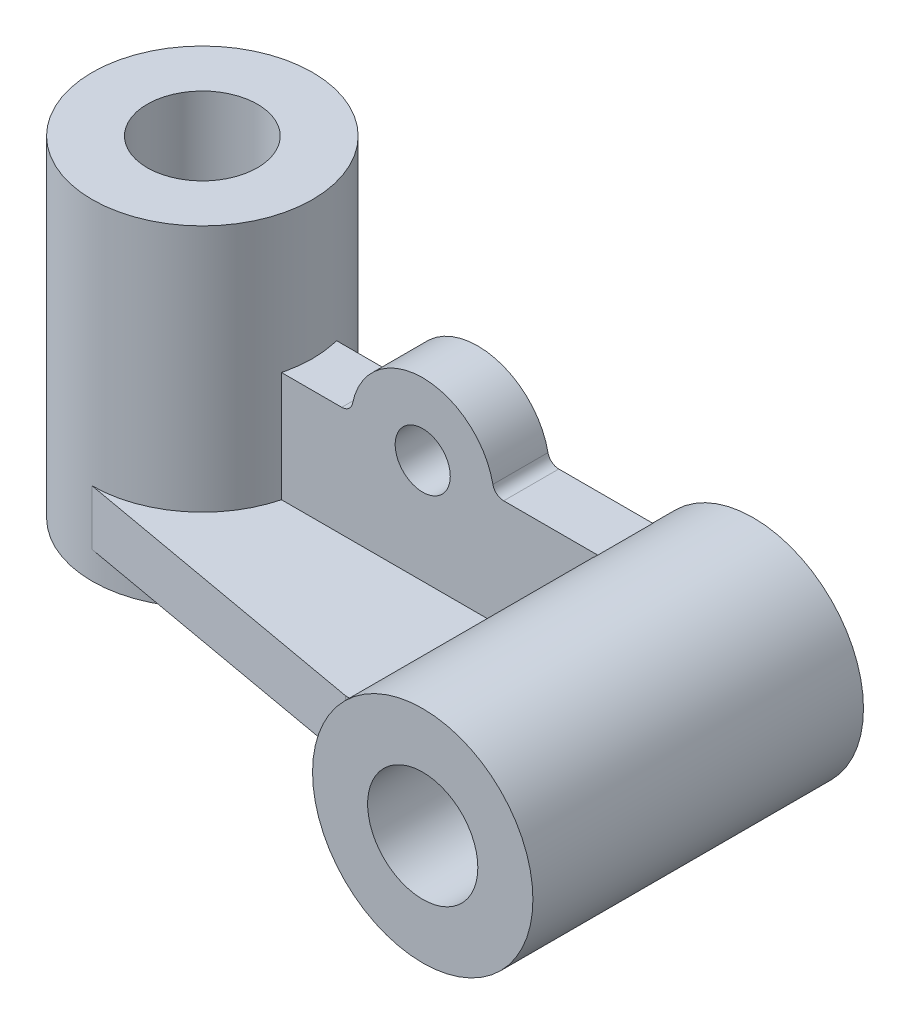
ISO-10303-21;
HEADER;
FILE_DESCRIPTION(('STEP AP214'),'2;1');
FILE_NAME('part.step','',(''),(''),'','','');
FILE_SCHEMA(('AUTOMOTIVE_DESIGN { 1 0 10303 214 1 1 1 1 }'));
ENDSEC;
DATA;
#1=APPLICATION_CONTEXT('core data for automotive mechanical design processes');
#2=APPLICATION_PROTOCOL_DEFINITION('international standard','automotive_design',2000,#1);
#3=PRODUCT_CONTEXT('',#1,'mechanical');
#4=PRODUCT('Part','Part','',(#3));
#5=PRODUCT_RELATED_PRODUCT_CATEGORY('part','',(#4));
#6=PRODUCT_DEFINITION_FORMATION('','',#4);
#7=PRODUCT_DEFINITION_CONTEXT('part definition',#1,'design');
#8=PRODUCT_DEFINITION('design','',#6,#7);
#9=PRODUCT_DEFINITION_SHAPE('','',#8);
#10=(LENGTH_UNIT() NAMED_UNIT(*) SI_UNIT(.MILLI.,.METRE.));
#11=(NAMED_UNIT(*) PLANE_ANGLE_UNIT() SI_UNIT($,.RADIAN.));
#12=(NAMED_UNIT(*) SI_UNIT($,.STERADIAN.) SOLID_ANGLE_UNIT());
#13=UNCERTAINTY_MEASURE_WITH_UNIT(LENGTH_MEASURE(1.E-05),#10,'distance_accuracy_value','');
#14=(GEOMETRIC_REPRESENTATION_CONTEXT(3) GLOBAL_UNCERTAINTY_ASSIGNED_CONTEXT((#13)) GLOBAL_UNIT_ASSIGNED_CONTEXT((#10,
#11,#12)) REPRESENTATION_CONTEXT('',''));
#15=CARTESIAN_POINT('',(0.,0.,0.));
#16=DIRECTION('',(0.,0.,1.));
#17=DIRECTION('',(1.,0.,0.));
#18=AXIS2_PLACEMENT_3D('',#15,#16,#17);
#19=CARTESIAN_POINT('',(77.3091008088365,-15.,30.));
#20=DIRECTION('',(-1.,0.,0.));
#21=DIRECTION('',(0.,0.,1.));
#22=AXIS2_PLACEMENT_3D('',#19,#20,#21);
#23=PLANE('',#22);
#24=DIRECTION('',(0.,0.,-1.));
#25=VECTOR('',#24,1.);
#26=CARTESIAN_POINT('',(77.3091008088365,-25.,30.));
#27=LINE('',#26,#25);
#28=CARTESIAN_POINT('',(77.3091008088365,-25.,30.));
#29=VERTEX_POINT('',#28);
#30=CARTESIAN_POINT('',(77.3091008088365,-25.,5.));
#31=VERTEX_POINT('',#30);
#32=EDGE_CURVE('E121',#29,#31,#27,.T.);
#33=ORIENTED_EDGE('',*,*,#32,.T.);
#34=DIRECTION('',(0.,-1.,0.));
#35=VECTOR('',#34,1.);
#36=CARTESIAN_POINT('',(77.3091008088365,-15.,5.));
#37=LINE('',#36,#35);
#38=CARTESIAN_POINT('',(77.3091008088365,-15.,5.));
#39=VERTEX_POINT('',#38);
#40=EDGE_CURVE('E12',#39,#31,#37,.T.);
#41=ORIENTED_EDGE('',*,*,#40,.F.);
#42=DIRECTION('',(0.,0.,-1.));
#43=VECTOR('',#42,1.);
#44=CARTESIAN_POINT('',(77.3091008088365,-15.,30.));
#45=LINE('',#44,#43);
#46=CARTESIAN_POINT('',(77.3091008088365,-15.,30.));
#47=VERTEX_POINT('',#46);
#48=EDGE_CURVE('E129',#47,#39,#45,.T.);
#49=ORIENTED_EDGE('',*,*,#48,.F.);
#50=DIRECTION('',(0.,-1.,0.));
#51=VECTOR('',#50,1.);
#52=CARTESIAN_POINT('',(77.3091008088365,-15.,30.));
#53=LINE('',#52,#51);
#54=EDGE_CURVE('E117',#47,#29,#53,.T.);
#55=ORIENTED_EDGE('',*,*,#54,.T.);
#56=EDGE_LOOP('',(#33,#41,#49,#55));
#57=FACE_BOUND('',#56,.T.);
#58=ADVANCED_FACE('F47',(#57),#23,.F.);
#59=CARTESIAN_POINT('',(19.3649167310371,-15.,5.));
#60=DIRECTION('',(0.,0.,1.));
#61=DIRECTION('',(1.,0.,0.));
#62=AXIS2_PLACEMENT_3D('',#59,#60,#61);
#63=PLANE('',#62);
#64=DIRECTION('',(-1.,0.,0.));
#65=VECTOR('',#64,1.);
#66=CARTESIAN_POINT('',(19.3649167310371,-25.,5.));
#67=LINE('',#66,#65);
#68=CARTESIAN_POINT('',(19.3649167310371,-25.,5.));
#69=VERTEX_POINT('',#68);
#70=EDGE_CURVE('E124',#31,#69,#67,.T.);
#71=ORIENTED_EDGE('',*,*,#70,.T.);
#72=DIRECTION('',(0.,-1.,0.));
#73=VECTOR('',#72,1.);
#74=CARTESIAN_POINT('',(19.3649167310371,-15.,5.));
#75=LINE('',#74,#73);
#76=CARTESIAN_POINT('',(19.3649167310371,-15.,5.));
#77=VERTEX_POINT('',#76);
#78=EDGE_CURVE('E55',#77,#69,#75,.T.);
#79=ORIENTED_EDGE('',*,*,#78,.F.);
#80=DIRECTION('',(-1.,0.,0.));
#81=VECTOR('',#80,1.);
#82=CARTESIAN_POINT('',(19.3649167310371,-15.,5.));
#83=LINE('',#82,#81);
#84=EDGE_CURVE('E97',#39,#77,#83,.T.);
#85=ORIENTED_EDGE('',*,*,#84,.F.);
#86=ORIENTED_EDGE('',*,*,#40,.T.);
#87=EDGE_LOOP('',(#71,#79,#85,#86));
#88=FACE_BOUND('',#87,.T.);
#89=ADVANCED_FACE('F148',(#88),#63,.F.);
#90=CARTESIAN_POINT('',(0.,-15.,0.));
#91=DIRECTION('',(0.,-1.,0.));
#92=DIRECTION('',(0.,0.,-1.));
#93=AXIS2_PLACEMENT_3D('',#90,#91,#92);
#94=CYLINDRICAL_SURFACE('',#93,20.);
#95=CARTESIAN_POINT('',(0.,-25.,0.));
#96=DIRECTION('',(0.,-1.,0.));
#97=DIRECTION('',(0.,0.,1.));
#98=AXIS2_PLACEMENT_3D('',#95,#96,#97);
#99=CIRCLE('',#98,20.);
#100=CARTESIAN_POINT('',(0.,-25.,20.));
#101=VERTEX_POINT('',#100);
#102=EDGE_CURVE('E112',#69,#101,#99,.T.);
#103=ORIENTED_EDGE('',*,*,#102,.T.);
#104=DIRECTION('',(0.,-1.,0.));
#105=VECTOR('',#104,1.);
#106=CARTESIAN_POINT('',(0.,-15.,20.));
#107=LINE('',#106,#105);
#108=CARTESIAN_POINT('',(0.,-15.,20.));
#109=VERTEX_POINT('',#108);
#110=EDGE_CURVE('E109',#109,#101,#107,.T.);
#111=ORIENTED_EDGE('',*,*,#110,.F.);
#112=CARTESIAN_POINT('',(0.,-15.,0.));
#113=DIRECTION('',(0.,-1.,0.));
#114=DIRECTION('',(0.,0.,1.));
#115=AXIS2_PLACEMENT_3D('',#112,#113,#114);
#116=CIRCLE('',#115,20.);
#117=EDGE_CURVE('E101',#77,#109,#116,.T.);
#118=ORIENTED_EDGE('',*,*,#117,.F.);
#119=ORIENTED_EDGE('',*,*,#78,.T.);
#120=EDGE_LOOP('',(#103,#111,#118,#119));
#121=FACE_BOUND('',#120,.T.);
#122=ADVANCED_FACE('F110',(#121),#94,.F.);
#123=CARTESIAN_POINT('',(0.,-15.,20.));
#124=DIRECTION('',(0.175790638483658,0.,-0.984427575508482));
#125=DIRECTION('',(-0.984427575508482,0.,-0.175790638483658));
#126=AXIS2_PLACEMENT_3D('',#123,#124,#125);
#127=PLANE('',#126);
#128=DIRECTION('',(0.984427575508482,0.,0.175790638483658));
#129=VECTOR('',#128,1.);
#130=CARTESIAN_POINT('',(0.,-25.,20.));
#131=LINE('',#130,#129);
#132=CARTESIAN_POINT('',(56.,-25.,30.));
#133=VERTEX_POINT('',#132);
#134=EDGE_CURVE('E83',#101,#133,#131,.T.);
#135=ORIENTED_EDGE('',*,*,#134,.T.);
#136=DIRECTION('',(0.,-1.,0.));
#137=VECTOR('',#136,1.);
#138=CARTESIAN_POINT('',(56.,-15.,30.));
#139=LINE('',#138,#137);
#140=CARTESIAN_POINT('',(56.,-15.,30.));
#141=VERTEX_POINT('',#140);
#142=EDGE_CURVE('E113',#141,#133,#139,.T.);
#143=ORIENTED_EDGE('',*,*,#142,.F.);
#144=DIRECTION('',(0.984427575508482,0.,0.175790638483658));
#145=VECTOR('',#144,1.);
#146=CARTESIAN_POINT('',(0.,-15.,20.));
#147=LINE('',#146,#145);
#148=EDGE_CURVE('E105',#109,#141,#147,.T.);
#149=ORIENTED_EDGE('',*,*,#148,.F.);
#150=ORIENTED_EDGE('',*,*,#110,.T.);
#151=EDGE_LOOP('',(#135,#143,#149,#150));
#152=FACE_BOUND('',#151,.T.);
#153=ADVANCED_FACE('F115',(#152),#127,.F.);
#154=CARTESIAN_POINT('',(56.,-15.,30.));
#155=DIRECTION('',(0.,0.,-1.));
#156=DIRECTION('',(-1.,0.,0.));
#157=AXIS2_PLACEMENT_3D('',#154,#155,#156);
#158=PLANE('',#157);
#159=DIRECTION('',(1.,0.,0.));
#160=VECTOR('',#159,1.);
#161=CARTESIAN_POINT('',(56.,-25.,30.));
#162=LINE('',#161,#160);
#163=EDGE_CURVE('E89',#133,#29,#162,.T.);
#164=ORIENTED_EDGE('',*,*,#163,.T.);
#165=ORIENTED_EDGE('',*,*,#54,.F.);
#166=DIRECTION('',(1.,0.,0.));
#167=VECTOR('',#166,1.);
#168=CARTESIAN_POINT('',(56.,-15.,30.));
#169=LINE('',#168,#167);
#170=EDGE_CURVE('E63',#141,#47,#169,.T.);
#171=ORIENTED_EDGE('',*,*,#170,.F.);
#172=ORIENTED_EDGE('',*,*,#142,.T.);
#173=EDGE_LOOP('',(#164,#165,#171,#172));
#174=FACE_BOUND('',#173,.T.);
#175=ADVANCED_FACE('F137',(#174),#158,.F.);
#176=CARTESIAN_POINT('',(0.,-15.,0.));
#177=DIRECTION('',(0.,1.,0.));
#178=DIRECTION('',(0.,0.,1.));
#179=AXIS2_PLACEMENT_3D('',#176,#177,#178);
#180=PLANE('',#179);
#181=ORIENTED_EDGE('',*,*,#48,.T.);
#182=ORIENTED_EDGE('',*,*,#84,.T.);
#183=ORIENTED_EDGE('',*,*,#117,.T.);
#184=ORIENTED_EDGE('',*,*,#148,.T.);
#185=ORIENTED_EDGE('',*,*,#170,.T.);
#186=EDGE_LOOP('',(#181,#182,#183,#184,#185));
#187=FACE_BOUND('',#186,.T.);
#188=ADVANCED_FACE('F103',(#187),#180,.T.);
#189=CARTESIAN_POINT('',(0.,-25.,0.));
#190=DIRECTION('',(0.,1.,0.));
#191=DIRECTION('',(0.,0.,1.));
#192=AXIS2_PLACEMENT_3D('',#189,#190,#191);
#193=PLANE('',#192);
#194=ORIENTED_EDGE('',*,*,#32,.F.);
#195=ORIENTED_EDGE('',*,*,#163,.F.);
#196=ORIENTED_EDGE('',*,*,#134,.F.);
#197=ORIENTED_EDGE('',*,*,#102,.F.);
#198=ORIENTED_EDGE('',*,*,#70,.F.);
#199=EDGE_LOOP('',(#194,#195,#196,#197,#198));
#200=FACE_BOUND('',#199,.T.);
#201=ADVANCED_FACE('F133',(#200),#193,.F.);
#202=CLOSED_SHELL('',(#58,#89,#122,#153,#175,#188,#201));
#203=MANIFOLD_SOLID_BREP('B2',#202);
#204=CARTESIAN_POINT('',(90.0000000000001,-10.,5.));
#205=DIRECTION('',(0.,0.,-1.));
#206=DIRECTION('',(-1.,0.,0.));
#207=AXIS2_PLACEMENT_3D('',#204,#205,#206);
#208=PLANE('',#207);
#209=DIRECTION('',(0.,-1.,0.));
#210=VECTOR('',#209,1.);
#211=CARTESIAN_POINT('',(10.,5.,5.));
#212=LINE('',#211,#210);
#213=CARTESIAN_POINT('',(10.,5.,5.));
#214=VERTEX_POINT('',#213);
#215=CARTESIAN_POINT('',(10.,-15.,5.));
#216=VERTEX_POINT('',#215);
#217=EDGE_CURVE('E316',#214,#216,#212,.T.);
#218=ORIENTED_EDGE('',*,*,#217,.T.);
#219=DIRECTION('',(1.,0.,0.));
#220=VECTOR('',#219,1.);
#221=CARTESIAN_POINT('',(10.,-15.,5.));
#222=LINE('',#221,#220);
#223=CARTESIAN_POINT('',(70.6350832689629,-15.,5.));
#224=VERTEX_POINT('',#223);
#225=EDGE_CURVE('E264',#216,#224,#222,.T.);
#226=ORIENTED_EDGE('',*,*,#225,.T.);
#227=CARTESIAN_POINT('',(90.0000000000001,-10.,5.));
#228=DIRECTION('',(0.,0.,-1.));
#229=DIRECTION('',(-1.,0.,0.));
#230=AXIS2_PLACEMENT_3D('',#227,#228,#229);
#231=CIRCLE('',#230,20.);
#232=CARTESIAN_POINT('',(76.7712434446771,5.,5.));
#233=VERTEX_POINT('',#232);
#234=EDGE_CURVE('E331',#224,#233,#231,.T.);
#235=ORIENTED_EDGE('',*,*,#234,.T.);
#236=DIRECTION('',(-1.,0.,0.));
#237=VECTOR('',#236,1.);
#238=CARTESIAN_POINT('',(59.6969384566991,5.,5.));
#239=LINE('',#238,#237);
#240=CARTESIAN_POINT('',(59.6969384566991,5.,5.));
#241=VERTEX_POINT('',#240);
#242=EDGE_CURVE('E344',#233,#241,#239,.T.);
#243=ORIENTED_EDGE('',*,*,#242,.T.);
#244=CARTESIAN_POINT('',(59.6969384566991,7.,5.));
#245=DIRECTION('',(0.,0.,-1.));
#246=DIRECTION('',(-1.,0.,0.));
#247=AXIS2_PLACEMENT_3D('',#244,#245,#246);
#248=CIRCLE('',#247,2.);
#249=CARTESIAN_POINT('',(57.7373466624725,6.6,5.));
#250=VERTEX_POINT('',#249);
#251=EDGE_CURVE('E283',#241,#250,#248,.T.);
#252=ORIENTED_EDGE('',*,*,#251,.T.);
#253=CARTESIAN_POINT('',(45.,4.,5.));
#254=DIRECTION('',(0.,0.,1.));
#255=DIRECTION('',(-1.,0.,0.));
#256=AXIS2_PLACEMENT_3D('',#253,#254,#255);
#257=CIRCLE('',#256,13.);
#258=CARTESIAN_POINT('',(32.2626533375275,6.6,5.));
#259=VERTEX_POINT('',#258);
#260=EDGE_CURVE('E277',#250,#259,#257,.T.);
#261=ORIENTED_EDGE('',*,*,#260,.T.);
#262=CARTESIAN_POINT('',(30.303061543301,7.,5.));
#263=DIRECTION('',(0.,0.,-1.));
#264=DIRECTION('',(1.,0.,0.));
#265=AXIS2_PLACEMENT_3D('',#262,#263,#264);
#266=CIRCLE('',#265,2.);
#267=CARTESIAN_POINT('',(30.303061543301,5.,5.));
#268=VERTEX_POINT('',#267);
#269=EDGE_CURVE('E281',#259,#268,#266,.T.);
#270=ORIENTED_EDGE('',*,*,#269,.T.);
#271=DIRECTION('',(-1.,0.,0.));
#272=VECTOR('',#271,1.);
#273=CARTESIAN_POINT('',(10.,5.,5.));
#274=LINE('',#273,#272);
#275=EDGE_CURVE('E221',#268,#214,#274,.T.);
#276=ORIENTED_EDGE('',*,*,#275,.T.);
#277=EDGE_LOOP('',(#218,#226,#235,#243,#252,#261,#270,#276));
#278=FACE_BOUND('',#277,.T.);
#279=CARTESIAN_POINT('',(45.,4.,5.));
#280=DIRECTION('',(0.,0.,1.));
#281=DIRECTION('',(1.,0.,0.));
#282=AXIS2_PLACEMENT_3D('',#279,#280,#281);
#283=CIRCLE('',#282,5.);
#284=CARTESIAN_POINT('',(50.,4.,5.));
#285=VERTEX_POINT('',#284);
#286=EDGE_CURVE('E305',#285,#285,#283,.T.);
#287=ORIENTED_EDGE('',*,*,#286,.F.);
#288=EDGE_LOOP('',(#287));
#289=FACE_BOUND('',#288,.T.);
#290=ADVANCED_FACE('F204',(#278,#289),#208,.F.);
#291=CARTESIAN_POINT('',(90.0000000000001,-10.,-5.));
#292=DIRECTION('',(0.,0.,-1.));
#293=DIRECTION('',(-1.,0.,0.));
#294=AXIS2_PLACEMENT_3D('',#291,#292,#293);
#295=PLANE('',#294);
#296=DIRECTION('',(0.,-1.,0.));
#297=VECTOR('',#296,1.);
#298=CARTESIAN_POINT('',(10.,5.,-5.));
#299=LINE('',#298,#297);
#300=CARTESIAN_POINT('',(10.,5.,-5.));
#301=VERTEX_POINT('',#300);
#302=CARTESIAN_POINT('',(10.,-15.,-5.));
#303=VERTEX_POINT('',#302);
#304=EDGE_CURVE('E301',#301,#303,#299,.T.);
#305=ORIENTED_EDGE('',*,*,#304,.F.);
#306=DIRECTION('',(-1.,0.,0.));
#307=VECTOR('',#306,1.);
#308=CARTESIAN_POINT('',(10.,5.,-5.));
#309=LINE('',#308,#307);
#310=CARTESIAN_POINT('',(30.303061543301,5.,-5.));
#311=VERTEX_POINT('',#310);
#312=EDGE_CURVE('E256',#311,#301,#309,.T.);
#313=ORIENTED_EDGE('',*,*,#312,.F.);
#314=CARTESIAN_POINT('',(30.303061543301,7.,-5.));
#315=DIRECTION('',(0.,0.,-1.));
#316=DIRECTION('',(1.,0.,0.));
#317=AXIS2_PLACEMENT_3D('',#314,#315,#316);
#318=CIRCLE('',#317,2.);
#319=CARTESIAN_POINT('',(32.2626533375275,6.6,-5.));
#320=VERTEX_POINT('',#319);
#321=EDGE_CURVE('E250',#320,#311,#318,.T.);
#322=ORIENTED_EDGE('',*,*,#321,.F.);
#323=CARTESIAN_POINT('',(45.,4.,-5.));
#324=DIRECTION('',(0.,0.,1.));
#325=DIRECTION('',(-1.,0.,0.));
#326=AXIS2_PLACEMENT_3D('',#323,#324,#325);
#327=CIRCLE('',#326,13.);
#328=CARTESIAN_POINT('',(57.7373466624725,6.6,-5.));
#329=VERTEX_POINT('',#328);
#330=EDGE_CURVE('E291',#329,#320,#327,.T.);
#331=ORIENTED_EDGE('',*,*,#330,.F.);
#332=CARTESIAN_POINT('',(59.6969384566991,7.,-5.));
#333=DIRECTION('',(0.,0.,-1.));
#334=DIRECTION('',(-1.,0.,0.));
#335=AXIS2_PLACEMENT_3D('',#332,#333,#334);
#336=CIRCLE('',#335,2.);
#337=CARTESIAN_POINT('',(59.6969384566991,5.,-5.));
#338=VERTEX_POINT('',#337);
#339=EDGE_CURVE('E311',#338,#329,#336,.T.);
#340=ORIENTED_EDGE('',*,*,#339,.F.);
#341=DIRECTION('',(-1.,0.,0.));
#342=VECTOR('',#341,1.);
#343=CARTESIAN_POINT('',(59.6969384566991,5.,-5.));
#344=LINE('',#343,#342);
#345=CARTESIAN_POINT('',(76.7712434446771,5.,-5.));
#346=VERTEX_POINT('',#345);
#347=EDGE_CURVE('E309',#346,#338,#344,.T.);
#348=ORIENTED_EDGE('',*,*,#347,.F.);
#349=CARTESIAN_POINT('',(90.0000000000001,-10.,-5.));
#350=DIRECTION('',(0.,0.,-1.));
#351=DIRECTION('',(-1.,0.,0.));
#352=AXIS2_PLACEMENT_3D('',#349,#350,#351);
#353=CIRCLE('',#352,20.);
#354=CARTESIAN_POINT('',(70.6350832689629,-15.,-5.));
#355=VERTEX_POINT('',#354);
#356=EDGE_CURVE('E307',#355,#346,#353,.T.);
#357=ORIENTED_EDGE('',*,*,#356,.F.);
#358=DIRECTION('',(1.,0.,0.));
#359=VECTOR('',#358,1.);
#360=CARTESIAN_POINT('',(10.,-15.,-5.));
#361=LINE('',#360,#359);
#362=EDGE_CURVE('E304',#303,#355,#361,.T.);
#363=ORIENTED_EDGE('',*,*,#362,.F.);
#364=EDGE_LOOP('',(#305,#313,#322,#331,#340,#348,#357,#363));
#365=FACE_BOUND('',#364,.T.);
#366=CARTESIAN_POINT('',(45.,4.,-5.));
#367=DIRECTION('',(0.,0.,1.));
#368=DIRECTION('',(1.,0.,0.));
#369=AXIS2_PLACEMENT_3D('',#366,#367,#368);
#370=CIRCLE('',#369,5.);
#371=CARTESIAN_POINT('',(50.,4.,-5.));
#372=VERTEX_POINT('',#371);
#373=EDGE_CURVE('E350',#372,#372,#370,.T.);
#374=ORIENTED_EDGE('',*,*,#373,.T.);
#375=EDGE_LOOP('',(#374));
#376=FACE_BOUND('',#375,.T.);
#377=ADVANCED_FACE('F335',(#365,#376),#295,.T.);
#378=CARTESIAN_POINT('',(10.,5.,5.));
#379=DIRECTION('',(1.,0.,0.));
#380=DIRECTION('',(0.,1.,0.));
#381=AXIS2_PLACEMENT_3D('',#378,#379,#380);
#382=PLANE('',#381);
#383=ORIENTED_EDGE('',*,*,#304,.T.);
#384=DIRECTION('',(0.,0.,-1.));
#385=VECTOR('',#384,1.);
#386=CARTESIAN_POINT('',(10.,-15.,5.));
#387=LINE('',#386,#385);
#388=EDGE_CURVE('E45',#216,#303,#387,.T.);
#389=ORIENTED_EDGE('',*,*,#388,.F.);
#390=ORIENTED_EDGE('',*,*,#217,.F.);
#391=DIRECTION('',(0.,0.,-1.));
#392=VECTOR('',#391,1.);
#393=CARTESIAN_POINT('',(10.,5.,5.));
#394=LINE('',#393,#392);
#395=EDGE_CURVE('E297',#214,#301,#394,.T.);
#396=ORIENTED_EDGE('',*,*,#395,.T.);
#397=EDGE_LOOP('',(#383,#389,#390,#396));
#398=FACE_BOUND('',#397,.T.);
#399=ADVANCED_FACE('F206',(#398),#382,.F.);
#400=CARTESIAN_POINT('',(10.,-15.,5.));
#401=DIRECTION('',(0.,1.,0.));
#402=DIRECTION('',(0.,0.,1.));
#403=AXIS2_PLACEMENT_3D('',#400,#401,#402);
#404=PLANE('',#403);
#405=ORIENTED_EDGE('',*,*,#362,.T.);
#406=DIRECTION('',(0.,0.,-1.));
#407=VECTOR('',#406,1.);
#408=CARTESIAN_POINT('',(70.6350832689629,-15.,5.));
#409=LINE('',#408,#407);
#410=EDGE_CURVE('E213',#224,#355,#409,.T.);
#411=ORIENTED_EDGE('',*,*,#410,.F.);
#412=ORIENTED_EDGE('',*,*,#225,.F.);
#413=ORIENTED_EDGE('',*,*,#388,.T.);
#414=EDGE_LOOP('',(#405,#411,#412,#413));
#415=FACE_BOUND('',#414,.T.);
#416=ADVANCED_FACE('F378',(#415),#404,.F.);
#417=CARTESIAN_POINT('',(90.0000000000001,-10.,5.));
#418=DIRECTION('',(0.,0.,-1.));
#419=DIRECTION('',(-1.,0.,0.));
#420=AXIS2_PLACEMENT_3D('',#417,#418,#419);
#421=CYLINDRICAL_SURFACE('',#420,20.);
#422=ORIENTED_EDGE('',*,*,#356,.T.);
#423=DIRECTION('',(0.,0.,-1.));
#424=VECTOR('',#423,1.);
#425=CARTESIAN_POINT('',(76.7712434446771,5.,5.));
#426=LINE('',#425,#424);
#427=EDGE_CURVE('E323',#233,#346,#426,.T.);
#428=ORIENTED_EDGE('',*,*,#427,.F.);
#429=ORIENTED_EDGE('',*,*,#234,.F.);
#430=ORIENTED_EDGE('',*,*,#410,.T.);
#431=EDGE_LOOP('',(#422,#428,#429,#430));
#432=FACE_BOUND('',#431,.T.);
#433=ADVANCED_FACE('F329',(#432),#421,.F.);
#434=CARTESIAN_POINT('',(59.6969384566991,5.,5.));
#435=DIRECTION('',(0.,-1.,0.));
#436=DIRECTION('',(0.,0.,-1.));
#437=AXIS2_PLACEMENT_3D('',#434,#435,#436);
#438=PLANE('',#437);
#439=ORIENTED_EDGE('',*,*,#347,.T.);
#440=DIRECTION('',(0.,0.,-1.));
#441=VECTOR('',#440,1.);
#442=CARTESIAN_POINT('',(59.6969384566991,5.,5.));
#443=LINE('',#442,#441);
#444=EDGE_CURVE('E320',#241,#338,#443,.T.);
#445=ORIENTED_EDGE('',*,*,#444,.F.);
#446=ORIENTED_EDGE('',*,*,#242,.F.);
#447=ORIENTED_EDGE('',*,*,#427,.T.);
#448=EDGE_LOOP('',(#439,#445,#446,#447));
#449=FACE_BOUND('',#448,.T.);
#450=ADVANCED_FACE('F340',(#449),#438,.F.);
#451=CARTESIAN_POINT('',(59.6969384566991,7.,5.));
#452=DIRECTION('',(0.,0.,-1.));
#453=DIRECTION('',(-1.,0.,0.));
#454=AXIS2_PLACEMENT_3D('',#451,#452,#453);
#455=CYLINDRICAL_SURFACE('',#454,2.);
#456=ORIENTED_EDGE('',*,*,#339,.T.);
#457=DIRECTION('',(0.,0.,-1.));
#458=VECTOR('',#457,1.);
#459=CARTESIAN_POINT('',(57.7373466624725,6.6,5.));
#460=LINE('',#459,#458);
#461=EDGE_CURVE('E292',#250,#329,#460,.T.);
#462=ORIENTED_EDGE('',*,*,#461,.F.);
#463=ORIENTED_EDGE('',*,*,#251,.F.);
#464=ORIENTED_EDGE('',*,*,#444,.T.);
#465=EDGE_LOOP('',(#456,#462,#463,#464));
#466=FACE_BOUND('',#465,.T.);
#467=ADVANCED_FACE('F343',(#466),#455,.F.);
#468=CARTESIAN_POINT('',(45.,4.,5.));
#469=DIRECTION('',(0.,0.,-1.));
#470=DIRECTION('',(-1.,0.,0.));
#471=AXIS2_PLACEMENT_3D('',#468,#469,#470);
#472=CYLINDRICAL_SURFACE('',#471,13.);
#473=ORIENTED_EDGE('',*,*,#330,.T.);
#474=DIRECTION('',(0.,0.,-1.));
#475=VECTOR('',#474,1.);
#476=CARTESIAN_POINT('',(32.2626533375275,6.6,5.));
#477=LINE('',#476,#475);
#478=EDGE_CURVE('E288',#259,#320,#477,.T.);
#479=ORIENTED_EDGE('',*,*,#478,.F.);
#480=ORIENTED_EDGE('',*,*,#260,.F.);
#481=ORIENTED_EDGE('',*,*,#461,.T.);
#482=EDGE_LOOP('',(#473,#479,#480,#481));
#483=FACE_BOUND('',#482,.T.);
#484=ADVANCED_FACE('F289',(#483),#472,.T.);
#485=CARTESIAN_POINT('',(30.303061543301,7.,5.));
#486=DIRECTION('',(0.,0.,-1.));
#487=DIRECTION('',(-1.,0.,0.));
#488=AXIS2_PLACEMENT_3D('',#485,#486,#487);
#489=CYLINDRICAL_SURFACE('',#488,2.);
#490=ORIENTED_EDGE('',*,*,#321,.T.);
#491=DIRECTION('',(0.,0.,-1.));
#492=VECTOR('',#491,1.);
#493=CARTESIAN_POINT('',(30.303061543301,5.,5.));
#494=LINE('',#493,#492);
#495=EDGE_CURVE('E293',#268,#311,#494,.T.);
#496=ORIENTED_EDGE('',*,*,#495,.F.);
#497=ORIENTED_EDGE('',*,*,#269,.F.);
#498=ORIENTED_EDGE('',*,*,#478,.T.);
#499=EDGE_LOOP('',(#490,#496,#497,#498));
#500=FACE_BOUND('',#499,.T.);
#501=ADVANCED_FACE('F295',(#500),#489,.F.);
#502=CARTESIAN_POINT('',(10.,5.,5.));
#503=DIRECTION('',(0.,-1.,0.));
#504=DIRECTION('',(0.,0.,-1.));
#505=AXIS2_PLACEMENT_3D('',#502,#503,#504);
#506=PLANE('',#505);
#507=ORIENTED_EDGE('',*,*,#312,.T.);
#508=ORIENTED_EDGE('',*,*,#395,.F.);
#509=ORIENTED_EDGE('',*,*,#275,.F.);
#510=ORIENTED_EDGE('',*,*,#495,.T.);
#511=EDGE_LOOP('',(#507,#508,#509,#510));
#512=FACE_BOUND('',#511,.T.);
#513=ADVANCED_FACE('F366',(#512),#506,.F.);
#514=CARTESIAN_POINT('',(45.,4.,5.));
#515=DIRECTION('',(0.,0.,-1.));
#516=DIRECTION('',(-1.,0.,0.));
#517=AXIS2_PLACEMENT_3D('',#514,#515,#516);
#518=CYLINDRICAL_SURFACE('',#517,5.);
#519=ORIENTED_EDGE('',*,*,#286,.T.);
#520=EDGE_LOOP('',(#519));
#521=FACE_BOUND('',#520,.T.);
#522=ORIENTED_EDGE('',*,*,#373,.F.);
#523=EDGE_LOOP('',(#522));
#524=FACE_BOUND('',#523,.T.);
#525=ADVANCED_FACE('F356',(#521,#524),#518,.F.);
#526=CLOSED_SHELL('',(#290,#377,#399,#416,#433,#450,#467,#484,#501,#513,#525));
#527=MANIFOLD_SOLID_BREP('B6',#526);
#528=CARTESIAN_POINT('',(90.,-10.,-9.99999999999999));
#529=DIRECTION('',(0.,0.,1.));
#530=DIRECTION('',(1.,0.,0.));
#531=AXIS2_PLACEMENT_3D('',#528,#529,#530);
#532=CYLINDRICAL_SURFACE('',#531,20.);
#533=CARTESIAN_POINT('',(90.,-10.,-9.99999999999999));
#534=DIRECTION('',(0.,0.,1.));
#535=DIRECTION('',(1.,0.,0.));
#536=AXIS2_PLACEMENT_3D('',#533,#534,#535);
#537=CIRCLE('',#536,20.);
#538=CARTESIAN_POINT('',(110.,-10.,-9.99999999999999));
#539=VERTEX_POINT('',#538);
#540=EDGE_CURVE('E203',#539,#539,#537,.T.);
#541=ORIENTED_EDGE('',*,*,#540,.T.);
#542=EDGE_LOOP('',(#541));
#543=FACE_BOUND('',#542,.T.);
#544=CARTESIAN_POINT('',(90.,-10.,50.));
#545=DIRECTION('',(0.,0.,1.));
#546=DIRECTION('',(1.,0.,0.));
#547=AXIS2_PLACEMENT_3D('',#544,#545,#546);
#548=CIRCLE('',#547,20.);
#549=CARTESIAN_POINT('',(110.,-10.,50.));
#550=VERTEX_POINT('',#549);
#551=EDGE_CURVE('E462',#550,#550,#548,.T.);
#552=ORIENTED_EDGE('',*,*,#551,.F.);
#553=EDGE_LOOP('',(#552));
#554=FACE_BOUND('',#553,.T.);
#555=ADVANCED_FACE('F459',(#543,#554),#532,.T.);
#556=CARTESIAN_POINT('',(90.,-10.,-9.99999999999999));
#557=DIRECTION('',(0.,0.,1.));
#558=DIRECTION('',(1.,0.,0.));
#559=AXIS2_PLACEMENT_3D('',#556,#557,#558);
#560=PLANE('',#559);
#561=CARTESIAN_POINT('',(90.,-10.,-9.99999999999999));
#562=DIRECTION('',(0.,0.,1.));
#563=DIRECTION('',(1.,0.,0.));
#564=AXIS2_PLACEMENT_3D('',#561,#562,#563);
#565=CIRCLE('',#564,9.99999999999999);
#566=CARTESIAN_POINT('',(100.,-10.,-9.99999999999999));
#567=VERTEX_POINT('',#566);
#568=EDGE_CURVE('E469',#567,#567,#565,.T.);
#569=ORIENTED_EDGE('',*,*,#568,.T.);
#570=EDGE_LOOP('',(#569));
#571=FACE_BOUND('',#570,.T.);
#572=ORIENTED_EDGE('',*,*,#540,.F.);
#573=EDGE_LOOP('',(#572));
#574=FACE_BOUND('',#573,.T.);
#575=ADVANCED_FACE('F477',(#571,#574),#560,.F.);
#576=CARTESIAN_POINT('',(90.,-10.,50.));
#577=DIRECTION('',(0.,0.,1.));
#578=DIRECTION('',(1.,0.,0.));
#579=AXIS2_PLACEMENT_3D('',#576,#577,#578);
#580=PLANE('',#579);
#581=CARTESIAN_POINT('',(90.,-10.,50.));
#582=DIRECTION('',(0.,0.,1.));
#583=DIRECTION('',(1.,0.,0.));
#584=AXIS2_PLACEMENT_3D('',#581,#582,#583);
#585=CIRCLE('',#584,9.99999999999999);
#586=CARTESIAN_POINT('',(100.,-10.,50.));
#587=VERTEX_POINT('',#586);
#588=EDGE_CURVE('E471',#587,#587,#585,.T.);
#589=ORIENTED_EDGE('',*,*,#588,.F.);
#590=EDGE_LOOP('',(#589));
#591=FACE_BOUND('',#590,.T.);
#592=ORIENTED_EDGE('',*,*,#551,.T.);
#593=EDGE_LOOP('',(#592));
#594=FACE_BOUND('',#593,.T.);
#595=ADVANCED_FACE('F483',(#591,#594),#580,.T.);
#596=CARTESIAN_POINT('',(90.,-10.,-9.99999999999999));
#597=DIRECTION('',(0.,0.,1.));
#598=DIRECTION('',(1.,0.,0.));
#599=AXIS2_PLACEMENT_3D('',#596,#597,#598);
#600=CYLINDRICAL_SURFACE('',#599,9.99999999999999);
#601=ORIENTED_EDGE('',*,*,#568,.F.);
#602=EDGE_LOOP('',(#601));
#603=FACE_BOUND('',#602,.T.);
#604=ORIENTED_EDGE('',*,*,#588,.T.);
#605=EDGE_LOOP('',(#604));
#606=FACE_BOUND('',#605,.T.);
#607=ADVANCED_FACE('F480',(#603,#606),#600,.F.);
#608=CLOSED_SHELL('',(#555,#575,#595,#607));
#609=MANIFOLD_SOLID_BREP('B39',#608);
#610=CARTESIAN_POINT('',(20.,30.,0.));
#611=DIRECTION('',(0.,-1.,0.));
#612=DIRECTION('',(0.,0.,-1.));
#613=AXIS2_PLACEMENT_3D('',#610,#611,#612);
#614=PLANE('',#613);
#615=CARTESIAN_POINT('',(0.,30.,0.));
#616=DIRECTION('',(0.,1.,0.));
#617=DIRECTION('',(0.,0.,1.));
#618=AXIS2_PLACEMENT_3D('',#615,#616,#617);
#619=CIRCLE('',#618,10.);
#620=CARTESIAN_POINT('',(0.,30.,10.));
#621=VERTEX_POINT('',#620);
#622=EDGE_CURVE('E534',#621,#621,#619,.T.);
#623=ORIENTED_EDGE('',*,*,#622,.F.);
#624=EDGE_LOOP('',(#623));
#625=FACE_BOUND('',#624,.T.);
#626=CARTESIAN_POINT('',(0.,30.,0.));
#627=DIRECTION('',(0.,1.,0.));
#628=DIRECTION('',(0.,0.,1.));
#629=AXIS2_PLACEMENT_3D('',#626,#627,#628);
#630=CIRCLE('',#629,20.);
#631=CARTESIAN_POINT('',(0.,30.,20.));
#632=VERTEX_POINT('',#631);
#633=EDGE_CURVE('E526',#632,#632,#630,.T.);
#634=ORIENTED_EDGE('',*,*,#633,.T.);
#635=EDGE_LOOP('',(#634));
#636=FACE_BOUND('',#635,.T.);
#637=ADVANCED_FACE('F520',(#625,#636),#614,.F.);
#638=CARTESIAN_POINT('',(0.,-30.,0.));
#639=DIRECTION('',(0.,1.,0.));
#640=DIRECTION('',(0.,0.,1.));
#641=AXIS2_PLACEMENT_3D('',#638,#639,#640);
#642=PLANE('',#641);
#643=CARTESIAN_POINT('',(0.,-30.,0.));
#644=DIRECTION('',(0.,1.,0.));
#645=DIRECTION('',(0.,0.,1.));
#646=AXIS2_PLACEMENT_3D('',#643,#644,#645);
#647=CIRCLE('',#646,10.);
#648=CARTESIAN_POINT('',(0.,-30.,10.));
#649=VERTEX_POINT('',#648);
#650=EDGE_CURVE('E530',#649,#649,#647,.T.);
#651=ORIENTED_EDGE('',*,*,#650,.T.);
#652=EDGE_LOOP('',(#651));
#653=FACE_BOUND('',#652,.T.);
#654=CARTESIAN_POINT('',(0.,-30.,0.));
#655=DIRECTION('',(0.,1.,0.));
#656=DIRECTION('',(0.,0.,1.));
#657=AXIS2_PLACEMENT_3D('',#654,#655,#656);
#658=CIRCLE('',#657,20.);
#659=CARTESIAN_POINT('',(0.,-30.,20.));
#660=VERTEX_POINT('',#659);
#661=EDGE_CURVE('E458',#660,#660,#658,.T.);
#662=ORIENTED_EDGE('',*,*,#661,.F.);
#663=EDGE_LOOP('',(#662));
#664=FACE_BOUND('',#663,.T.);
#665=ADVANCED_FACE('F543',(#653,#664),#642,.F.);
#666=CARTESIAN_POINT('',(0.,30.,0.));
#667=DIRECTION('',(0.,1.,0.));
#668=DIRECTION('',(0.,0.,1.));
#669=AXIS2_PLACEMENT_3D('',#666,#667,#668);
#670=CYLINDRICAL_SURFACE('',#669,20.);
#671=ORIENTED_EDGE('',*,*,#633,.F.);
#672=EDGE_LOOP('',(#671));
#673=FACE_BOUND('',#672,.T.);
#674=ORIENTED_EDGE('',*,*,#661,.T.);
#675=EDGE_LOOP('',(#674));
#676=FACE_BOUND('',#675,.T.);
#677=ADVANCED_FACE('F547',(#673,#676),#670,.T.);
#678=CARTESIAN_POINT('',(0.,-30.,0.));
#679=DIRECTION('',(0.,1.,0.));
#680=DIRECTION('',(0.,0.,1.));
#681=AXIS2_PLACEMENT_3D('',#678,#679,#680);
#682=CYLINDRICAL_SURFACE('',#681,10.);
#683=ORIENTED_EDGE('',*,*,#650,.F.);
#684=EDGE_LOOP('',(#683));
#685=FACE_BOUND('',#684,.T.);
#686=ORIENTED_EDGE('',*,*,#622,.T.);
#687=EDGE_LOOP('',(#686));
#688=FACE_BOUND('',#687,.T.);
#689=ADVANCED_FACE('F540',(#685,#688),#682,.F.);
#690=CLOSED_SHELL('',(#637,#665,#677,#689));
#691=MANIFOLD_SOLID_BREP('B198',#690);
#692=ADVANCED_BREP_SHAPE_REPRESENTATION('',(#18,#203,#527,#609,#691),#14);
#693=SHAPE_DEFINITION_REPRESENTATION(#9,#692);
ENDSEC;
END-ISO-10303-21;
